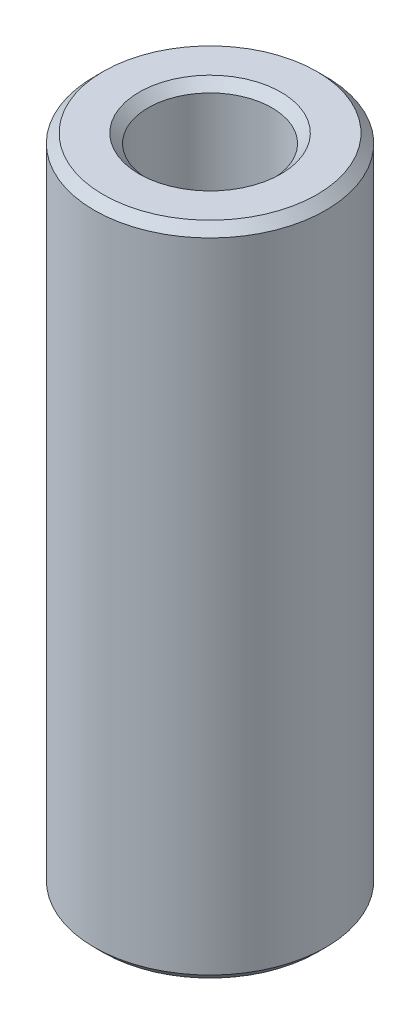
ISO-10303-21;
HEADER;
FILE_DESCRIPTION(('STEP AP214'),'2;1');
FILE_NAME('part.step','',(''),(''),'','','');
FILE_SCHEMA(('AUTOMOTIVE_DESIGN { 1 0 10303 214 1 1 1 1 }'));
ENDSEC;
DATA;
#1=APPLICATION_CONTEXT('core data for automotive mechanical design processes');
#2=APPLICATION_PROTOCOL_DEFINITION('international standard','automotive_design',2000,#1);
#3=PRODUCT_CONTEXT('',#1,'mechanical');
#4=PRODUCT('Part','Part','',(#3));
#5=PRODUCT_RELATED_PRODUCT_CATEGORY('part','',(#4));
#6=PRODUCT_DEFINITION_FORMATION('','',#4);
#7=PRODUCT_DEFINITION_CONTEXT('part definition',#1,'design');
#8=PRODUCT_DEFINITION('design','',#6,#7);
#9=PRODUCT_DEFINITION_SHAPE('','',#8);
#10=(LENGTH_UNIT() NAMED_UNIT(*) SI_UNIT(.MILLI.,.METRE.));
#11=(NAMED_UNIT(*) PLANE_ANGLE_UNIT() SI_UNIT($,.RADIAN.));
#12=(NAMED_UNIT(*) SI_UNIT($,.STERADIAN.) SOLID_ANGLE_UNIT());
#13=UNCERTAINTY_MEASURE_WITH_UNIT(LENGTH_MEASURE(1.E-05),#10,'distance_accuracy_value','');
#14=(GEOMETRIC_REPRESENTATION_CONTEXT(3) GLOBAL_UNCERTAINTY_ASSIGNED_CONTEXT((#13)) GLOBAL_UNIT_ASSIGNED_CONTEXT((#10,
#11,#12)) REPRESENTATION_CONTEXT('',''));
#15=CARTESIAN_POINT('',(0.,0.,0.));
#16=DIRECTION('',(0.,0.,1.));
#17=DIRECTION('',(1.,0.,0.));
#18=AXIS2_PLACEMENT_3D('',#15,#16,#17);
#19=CARTESIAN_POINT('',(0.,212.584975607768,0.));
#20=DIRECTION('',(0.,-1.,0.));
#21=DIRECTION('',(0.,0.,-1.));
#22=AXIS2_PLACEMENT_3D('',#19,#20,#21);
#23=CYLINDRICAL_SURFACE('',#22,37.5);
#24=CARTESIAN_POINT('',(0.,2.91858150792673,0.));
#25=DIRECTION('',(0.,1.,0.));
#26=DIRECTION('',(0.,0.,1.));
#27=AXIS2_PLACEMENT_3D('',#24,#25,#26);
#28=CIRCLE('',#27,37.5);
#29=CARTESIAN_POINT('',(0.,2.91858150792673,37.5));
#30=VERTEX_POINT('',#29);
#31=EDGE_CURVE('E10',#30,#30,#28,.T.);
#32=ORIENTED_EDGE('',*,*,#31,.T.);
#33=EDGE_LOOP('',(#32));
#34=FACE_BOUND('',#33,.T.);
#35=CARTESIAN_POINT('',(0.,209.666394099841,0.));
#36=DIRECTION('',(0.,1.,0.));
#37=DIRECTION('',(0.,0.,1.));
#38=AXIS2_PLACEMENT_3D('',#35,#36,#37);
#39=CIRCLE('',#38,37.5);
#40=CARTESIAN_POINT('',(0.,209.666394099841,37.5));
#41=VERTEX_POINT('',#40);
#42=EDGE_CURVE('E50',#41,#41,#39,.F.);
#43=ORIENTED_EDGE('',*,*,#42,.T.);
#44=EDGE_LOOP('',(#43));
#45=FACE_BOUND('',#44,.T.);
#46=ADVANCED_FACE('F39',(#34,#45),#23,.T.);
#47=CARTESIAN_POINT('',(0.,212.584975607768,0.));
#48=DIRECTION('',(0.,1.,0.));
#49=DIRECTION('',(0.,0.,1.));
#50=AXIS2_PLACEMENT_3D('',#47,#48,#49);
#51=PLANE('',#50);
#52=CARTESIAN_POINT('',(0.,212.584975607768,0.));
#53=DIRECTION('',(0.,1.,0.));
#54=DIRECTION('',(0.,0.,1.));
#55=AXIS2_PLACEMENT_3D('',#52,#53,#54);
#56=CIRCLE('',#55,22.9696437258713);
#57=CARTESIAN_POINT('',(0.,212.584975607768,22.9696437258713));
#58=VERTEX_POINT('',#57);
#59=EDGE_CURVE('E58',#58,#58,#56,.F.);
#60=ORIENTED_EDGE('',*,*,#59,.T.);
#61=EDGE_LOOP('',(#60));
#62=FACE_BOUND('',#61,.T.);
#63=CARTESIAN_POINT('',(0.,212.584975607768,0.));
#64=DIRECTION('',(0.,1.,0.));
#65=DIRECTION('',(0.,0.,1.));
#66=AXIS2_PLACEMENT_3D('',#63,#64,#65);
#67=CIRCLE('',#66,34.5814184920733);
#68=CARTESIAN_POINT('',(0.,212.584975607768,34.5814184920733));
#69=VERTEX_POINT('',#68);
#70=EDGE_CURVE('E61',#69,#69,#67,.T.);
#71=ORIENTED_EDGE('',*,*,#70,.T.);
#72=EDGE_LOOP('',(#71));
#73=FACE_BOUND('',#72,.T.);
#74=ADVANCED_FACE('F88',(#62,#73),#51,.T.);
#75=CARTESIAN_POINT('',(0.,0.,0.));
#76=DIRECTION('',(0.,1.,0.));
#77=DIRECTION('',(0.,0.,1.));
#78=AXIS2_PLACEMENT_3D('',#75,#76,#77);
#79=PLANE('',#78);
#80=CARTESIAN_POINT('',(0.,0.,0.));
#81=DIRECTION('',(0.,1.,0.));
#82=DIRECTION('',(0.,0.,1.));
#83=AXIS2_PLACEMENT_3D('',#80,#81,#82);
#84=CIRCLE('',#83,22.9696437258713);
#85=CARTESIAN_POINT('',(0.,0.,22.9696437258713));
#86=VERTEX_POINT('',#85);
#87=EDGE_CURVE('E51',#86,#86,#84,.T.);
#88=ORIENTED_EDGE('',*,*,#87,.T.);
#89=EDGE_LOOP('',(#88));
#90=FACE_BOUND('',#89,.T.);
#91=CARTESIAN_POINT('',(0.,0.,0.));
#92=DIRECTION('',(0.,1.,0.));
#93=DIRECTION('',(0.,0.,1.));
#94=AXIS2_PLACEMENT_3D('',#91,#92,#93);
#95=CIRCLE('',#94,34.5814184920732);
#96=CARTESIAN_POINT('',(0.,0.,34.5814184920732));
#97=VERTEX_POINT('',#96);
#98=EDGE_CURVE('E54',#97,#97,#95,.F.);
#99=ORIENTED_EDGE('',*,*,#98,.T.);
#100=EDGE_LOOP('',(#99));
#101=FACE_BOUND('',#100,.T.);
#102=ADVANCED_FACE('F83',(#90,#101),#79,.F.);
#103=CARTESIAN_POINT('',(0.,212.584975607768,0.));
#104=DIRECTION('',(0.,-1.,0.));
#105=DIRECTION('',(0.,0.,-1.));
#106=AXIS2_PLACEMENT_3D('',#103,#104,#105);
#107=CYLINDRICAL_SURFACE('',#106,20.0510622179446);
#108=CARTESIAN_POINT('',(0.,209.666394099841,0.));
#109=DIRECTION('',(0.,1.,0.));
#110=DIRECTION('',(0.,0.,1.));
#111=AXIS2_PLACEMENT_3D('',#108,#109,#110);
#112=CIRCLE('',#111,20.0510622179446);
#113=CARTESIAN_POINT('',(0.,209.666394099841,20.0510622179446));
#114=VERTEX_POINT('',#113);
#115=EDGE_CURVE('E67',#114,#114,#112,.T.);
#116=ORIENTED_EDGE('',*,*,#115,.T.);
#117=EDGE_LOOP('',(#116));
#118=FACE_BOUND('',#117,.T.);
#119=CARTESIAN_POINT('',(0.,2.91858150792673,0.));
#120=DIRECTION('',(0.,1.,0.));
#121=DIRECTION('',(0.,0.,1.));
#122=AXIS2_PLACEMENT_3D('',#119,#120,#121);
#123=CIRCLE('',#122,20.0510622179446);
#124=CARTESIAN_POINT('',(0.,2.91858150792673,20.0510622179446));
#125=VERTEX_POINT('',#124);
#126=EDGE_CURVE('E69',#125,#125,#123,.F.);
#127=ORIENTED_EDGE('',*,*,#126,.T.);
#128=EDGE_LOOP('',(#127));
#129=FACE_BOUND('',#128,.T.);
#130=ADVANCED_FACE('F71',(#118,#129),#107,.F.);
#131=CARTESIAN_POINT('',(0.,209.666394099841,0.));
#132=DIRECTION('',(0.,1.,0.));
#133=DIRECTION('',(0.,0.,1.));
#134=AXIS2_PLACEMENT_3D('',#131,#132,#133);
#135=CONICAL_SURFACE('',#134,20.0510622179446,0.785398163397447);
#136=ORIENTED_EDGE('',*,*,#59,.F.);
#137=EDGE_LOOP('',(#136));
#138=FACE_BOUND('',#137,.T.);
#139=ORIENTED_EDGE('',*,*,#115,.F.);
#140=EDGE_LOOP('',(#139));
#141=FACE_BOUND('',#140,.T.);
#142=ADVANCED_FACE('F77',(#138,#141),#135,.F.);
#143=CARTESIAN_POINT('',(0.,0.,0.));
#144=DIRECTION('',(0.,-1.,0.));
#145=DIRECTION('',(0.,0.,-1.));
#146=AXIS2_PLACEMENT_3D('',#143,#144,#145);
#147=CONICAL_SURFACE('',#146,22.9696437258713,0.785398163397447);
#148=ORIENTED_EDGE('',*,*,#126,.F.);
#149=EDGE_LOOP('',(#148));
#150=FACE_BOUND('',#149,.T.);
#151=ORIENTED_EDGE('',*,*,#87,.F.);
#152=EDGE_LOOP('',(#151));
#153=FACE_BOUND('',#152,.T.);
#154=ADVANCED_FACE('F73',(#150,#153),#147,.F.);
#155=CARTESIAN_POINT('',(0.,2.91858150792673,0.));
#156=DIRECTION('',(0.,1.,0.));
#157=DIRECTION('',(0.,0.,1.));
#158=AXIS2_PLACEMENT_3D('',#155,#156,#157);
#159=CONICAL_SURFACE('',#158,37.5,0.785398163397458);
#160=ORIENTED_EDGE('',*,*,#98,.F.);
#161=EDGE_LOOP('',(#160));
#162=FACE_BOUND('',#161,.T.);
#163=ORIENTED_EDGE('',*,*,#31,.F.);
#164=EDGE_LOOP('',(#163));
#165=FACE_BOUND('',#164,.T.);
#166=ADVANCED_FACE('F76',(#162,#165),#159,.T.);
#167=CARTESIAN_POINT('',(0.,212.584975607768,0.));
#168=DIRECTION('',(0.,-1.,0.));
#169=DIRECTION('',(0.,0.,-1.));
#170=AXIS2_PLACEMENT_3D('',#167,#168,#169);
#171=CONICAL_SURFACE('',#170,34.5814184920733,0.785398163397444);
#172=ORIENTED_EDGE('',*,*,#42,.F.);
#173=EDGE_LOOP('',(#172));
#174=FACE_BOUND('',#173,.T.);
#175=ORIENTED_EDGE('',*,*,#70,.F.);
#176=EDGE_LOOP('',(#175));
#177=FACE_BOUND('',#176,.T.);
#178=ADVANCED_FACE('F45',(#174,#177),#171,.T.);
#179=CLOSED_SHELL('',(#46,#74,#102,#130,#142,#154,#166,#178));
#180=MANIFOLD_SOLID_BREP('B2',#179);
#181=ADVANCED_BREP_SHAPE_REPRESENTATION('',(#18,#180),#14);
#182=SHAPE_DEFINITION_REPRESENTATION(#9,#181);
ENDSEC;
END-ISO-10303-21;
